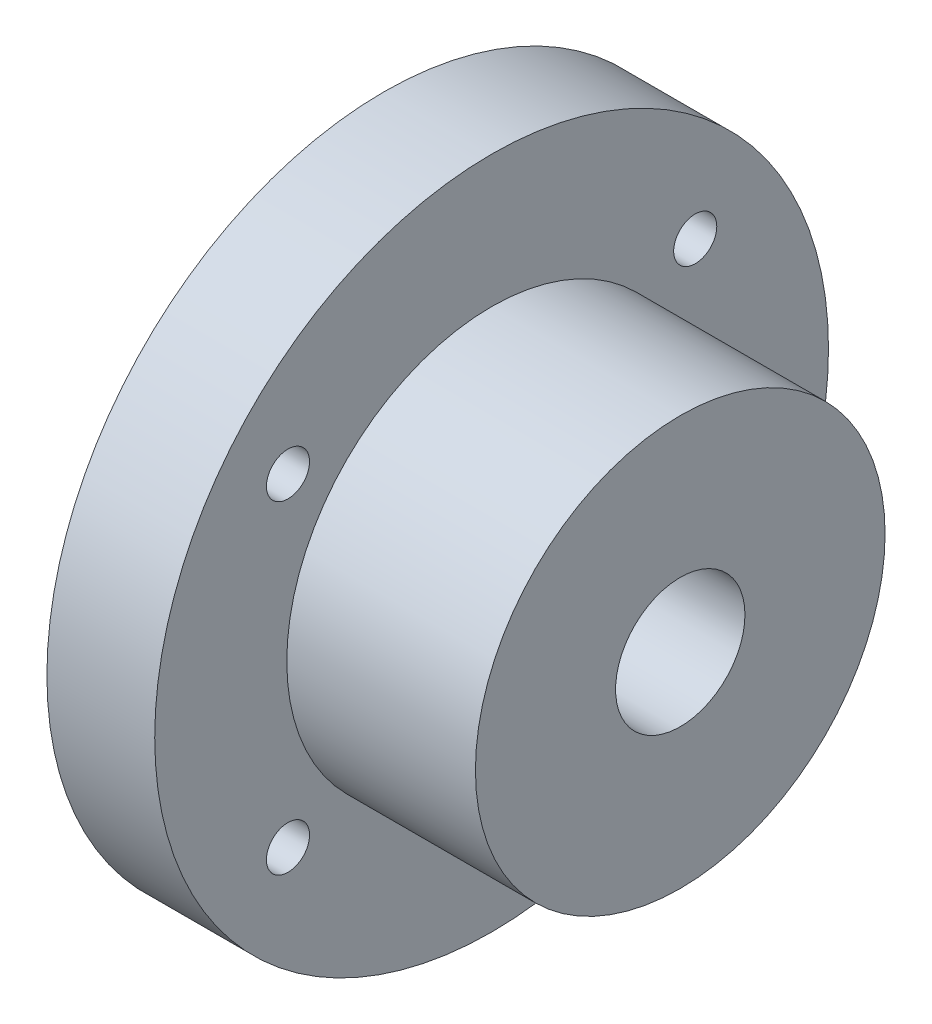
ISO-10303-21;
HEADER;
FILE_DESCRIPTION(('STEP AP214'),'2;1');
FILE_NAME('part.step','',(''),(''),'','','');
FILE_SCHEMA(('AUTOMOTIVE_DESIGN { 1 0 10303 214 1 1 1 1 }'));
ENDSEC;
DATA;
#1=APPLICATION_CONTEXT('core data for automotive mechanical design processes');
#2=APPLICATION_PROTOCOL_DEFINITION('international standard','automotive_design',2000,#1);
#3=PRODUCT_CONTEXT('',#1,'mechanical');
#4=PRODUCT('Part','Part','',(#3));
#5=PRODUCT_RELATED_PRODUCT_CATEGORY('part','',(#4));
#6=PRODUCT_DEFINITION_FORMATION('','',#4);
#7=PRODUCT_DEFINITION_CONTEXT('part definition',#1,'design');
#8=PRODUCT_DEFINITION('design','',#6,#7);
#9=PRODUCT_DEFINITION_SHAPE('','',#8);
#10=(LENGTH_UNIT() NAMED_UNIT(*) SI_UNIT(.MILLI.,.METRE.));
#11=(NAMED_UNIT(*) PLANE_ANGLE_UNIT() SI_UNIT($,.RADIAN.));
#12=(NAMED_UNIT(*) SI_UNIT($,.STERADIAN.) SOLID_ANGLE_UNIT());
#13=UNCERTAINTY_MEASURE_WITH_UNIT(LENGTH_MEASURE(1.E-05),#10,'distance_accuracy_value','');
#14=(GEOMETRIC_REPRESENTATION_CONTEXT(3) GLOBAL_UNCERTAINTY_ASSIGNED_CONTEXT((#13)) GLOBAL_UNIT_ASSIGNED_CONTEXT((#10,
#11,#12)) REPRESENTATION_CONTEXT('',''));
#15=CARTESIAN_POINT('',(0.,0.,0.));
#16=DIRECTION('',(0.,0.,1.));
#17=DIRECTION('',(1.,0.,0.));
#18=AXIS2_PLACEMENT_3D('',#15,#16,#17);
#19=CARTESIAN_POINT('',(20.,0.,0.));
#20=DIRECTION('',(1.,0.,0.));
#21=DIRECTION('',(0.,0.,-1.));
#22=AXIS2_PLACEMENT_3D('',#19,#20,#21);
#23=PLANE('',#22);
#24=CARTESIAN_POINT('',(20.,0.,0.));
#25=DIRECTION('',(1.,0.,0.));
#26=DIRECTION('',(0.,0.,-1.));
#27=AXIS2_PLACEMENT_3D('',#24,#25,#26);
#28=CIRCLE('',#27,38.);
#29=CARTESIAN_POINT('',(20.,0.,-38.));
#30=VERTEX_POINT('',#29);
#31=EDGE_CURVE('E76',#30,#30,#28,.T.);
#32=ORIENTED_EDGE('',*,*,#31,.F.);
#33=EDGE_LOOP('',(#32));
#34=FACE_BOUND('',#33,.T.);
#35=CARTESIAN_POINT('',(20.,-30.,-37.775));
#36=DIRECTION('',(1.,0.,0.));
#37=DIRECTION('',(0.,0.,-1.));
#38=AXIS2_PLACEMENT_3D('',#35,#36,#37);
#39=CIRCLE('',#38,4.);
#40=CARTESIAN_POINT('',(20.,-30.,-41.775));
#41=VERTEX_POINT('',#40);
#42=EDGE_CURVE('E61',#41,#41,#39,.T.);
#43=ORIENTED_EDGE('',*,*,#42,.F.);
#44=EDGE_LOOP('',(#43));
#45=FACE_BOUND('',#44,.T.);
#46=CARTESIAN_POINT('',(20.,30.,37.775));
#47=DIRECTION('',(1.,0.,0.));
#48=DIRECTION('',(0.,0.,-1.));
#49=AXIS2_PLACEMENT_3D('',#46,#47,#48);
#50=CIRCLE('',#49,4.);
#51=CARTESIAN_POINT('',(20.,30.,33.775));
#52=VERTEX_POINT('',#51);
#53=EDGE_CURVE('E50',#52,#52,#50,.T.);
#54=ORIENTED_EDGE('',*,*,#53,.F.);
#55=EDGE_LOOP('',(#54));
#56=FACE_BOUND('',#55,.T.);
#57=CARTESIAN_POINT('',(20.,0.,0.));
#58=DIRECTION('',(1.,0.,0.));
#59=DIRECTION('',(0.,0.,-1.));
#60=AXIS2_PLACEMENT_3D('',#57,#58,#59);
#61=CIRCLE('',#60,62.5);
#62=CARTESIAN_POINT('',(20.,0.,-62.5));
#63=VERTEX_POINT('',#62);
#64=EDGE_CURVE('E10',#63,#63,#61,.T.);
#65=ORIENTED_EDGE('',*,*,#64,.T.);
#66=EDGE_LOOP('',(#65));
#67=FACE_BOUND('',#66,.T.);
#68=CARTESIAN_POINT('',(20.,30.,-37.775));
#69=DIRECTION('',(1.,0.,0.));
#70=DIRECTION('',(0.,0.,-1.));
#71=AXIS2_PLACEMENT_3D('',#68,#69,#70);
#72=CIRCLE('',#71,4.);
#73=CARTESIAN_POINT('',(20.,30.,-41.775));
#74=VERTEX_POINT('',#73);
#75=EDGE_CURVE('E55',#74,#74,#72,.T.);
#76=ORIENTED_EDGE('',*,*,#75,.F.);
#77=EDGE_LOOP('',(#76));
#78=FACE_BOUND('',#77,.T.);
#79=CARTESIAN_POINT('',(20.,-30.,37.775));
#80=DIRECTION('',(1.,0.,0.));
#81=DIRECTION('',(0.,0.,-1.));
#82=AXIS2_PLACEMENT_3D('',#79,#80,#81);
#83=CIRCLE('',#82,4.);
#84=CARTESIAN_POINT('',(20.,-30.,33.775));
#85=VERTEX_POINT('',#84);
#86=EDGE_CURVE('E67',#85,#85,#83,.T.);
#87=ORIENTED_EDGE('',*,*,#86,.F.);
#88=EDGE_LOOP('',(#87));
#89=FACE_BOUND('',#88,.T.);
#90=ADVANCED_FACE('F39',(#34,#45,#56,#67,#78,#89),#23,.T.);
#91=CARTESIAN_POINT('',(0.,0.,0.));
#92=DIRECTION('',(1.,0.,0.));
#93=DIRECTION('',(0.,0.,-1.));
#94=AXIS2_PLACEMENT_3D('',#91,#92,#93);
#95=PLANE('',#94);
#96=CARTESIAN_POINT('',(0.,0.,0.));
#97=DIRECTION('',(1.,0.,0.));
#98=DIRECTION('',(0.,0.,-1.));
#99=AXIS2_PLACEMENT_3D('',#96,#97,#98);
#100=CIRCLE('',#99,62.5);
#101=CARTESIAN_POINT('',(0.,0.,-62.5));
#102=VERTEX_POINT('',#101);
#103=EDGE_CURVE('E43',#102,#102,#100,.T.);
#104=ORIENTED_EDGE('',*,*,#103,.F.);
#105=EDGE_LOOP('',(#104));
#106=FACE_BOUND('',#105,.T.);
#107=CARTESIAN_POINT('',(0.,30.,37.775));
#108=DIRECTION('',(1.,0.,0.));
#109=DIRECTION('',(0.,0.,-1.));
#110=AXIS2_PLACEMENT_3D('',#107,#108,#109);
#111=CIRCLE('',#110,4.);
#112=CARTESIAN_POINT('',(0.,30.,33.775));
#113=VERTEX_POINT('',#112);
#114=EDGE_CURVE('E52',#113,#113,#111,.T.);
#115=ORIENTED_EDGE('',*,*,#114,.T.);
#116=EDGE_LOOP('',(#115));
#117=FACE_BOUND('',#116,.T.);
#118=CARTESIAN_POINT('',(0.,30.,-37.775));
#119=DIRECTION('',(1.,0.,0.));
#120=DIRECTION('',(0.,0.,-1.));
#121=AXIS2_PLACEMENT_3D('',#118,#119,#120);
#122=CIRCLE('',#121,4.);
#123=CARTESIAN_POINT('',(0.,30.,-41.775));
#124=VERTEX_POINT('',#123);
#125=EDGE_CURVE('E58',#124,#124,#122,.T.);
#126=ORIENTED_EDGE('',*,*,#125,.T.);
#127=EDGE_LOOP('',(#126));
#128=FACE_BOUND('',#127,.T.);
#129=CARTESIAN_POINT('',(0.,-30.,-37.775));
#130=DIRECTION('',(1.,0.,0.));
#131=DIRECTION('',(0.,0.,-1.));
#132=AXIS2_PLACEMENT_3D('',#129,#130,#131);
#133=CIRCLE('',#132,4.);
#134=CARTESIAN_POINT('',(0.,-30.,-41.775));
#135=VERTEX_POINT('',#134);
#136=EDGE_CURVE('E64',#135,#135,#133,.T.);
#137=ORIENTED_EDGE('',*,*,#136,.T.);
#138=EDGE_LOOP('',(#137));
#139=FACE_BOUND('',#138,.T.);
#140=CARTESIAN_POINT('',(0.,-30.,37.775));
#141=DIRECTION('',(1.,0.,0.));
#142=DIRECTION('',(0.,0.,-1.));
#143=AXIS2_PLACEMENT_3D('',#140,#141,#142);
#144=CIRCLE('',#143,4.);
#145=CARTESIAN_POINT('',(0.,-30.,33.775));
#146=VERTEX_POINT('',#145);
#147=EDGE_CURVE('E70',#146,#146,#144,.T.);
#148=ORIENTED_EDGE('',*,*,#147,.T.);
#149=EDGE_LOOP('',(#148));
#150=FACE_BOUND('',#149,.T.);
#151=ADVANCED_FACE('F111',(#106,#117,#128,#139,#150),#95,.F.);
#152=CARTESIAN_POINT('',(20.,0.,0.));
#153=DIRECTION('',(-1.,0.,0.));
#154=DIRECTION('',(0.,0.,1.));
#155=AXIS2_PLACEMENT_3D('',#152,#153,#154);
#156=CYLINDRICAL_SURFACE('',#155,62.5);
#157=ORIENTED_EDGE('',*,*,#64,.F.);
#158=EDGE_LOOP('',(#157));
#159=FACE_BOUND('',#158,.T.);
#160=ORIENTED_EDGE('',*,*,#103,.T.);
#161=EDGE_LOOP('',(#160));
#162=FACE_BOUND('',#161,.T.);
#163=ADVANCED_FACE('F41',(#159,#162),#156,.T.);
#164=CARTESIAN_POINT('',(20.,30.,37.775));
#165=DIRECTION('',(-1.,0.,0.));
#166=DIRECTION('',(0.,0.,1.));
#167=AXIS2_PLACEMENT_3D('',#164,#165,#166);
#168=CYLINDRICAL_SURFACE('',#167,4.);
#169=ORIENTED_EDGE('',*,*,#53,.T.);
#170=EDGE_LOOP('',(#169));
#171=FACE_BOUND('',#170,.T.);
#172=ORIENTED_EDGE('',*,*,#114,.F.);
#173=EDGE_LOOP('',(#172));
#174=FACE_BOUND('',#173,.T.);
#175=ADVANCED_FACE('F132',(#171,#174),#168,.F.);
#176=CARTESIAN_POINT('',(20.,30.,-37.775));
#177=DIRECTION('',(-1.,0.,0.));
#178=DIRECTION('',(0.,0.,1.));
#179=AXIS2_PLACEMENT_3D('',#176,#177,#178);
#180=CYLINDRICAL_SURFACE('',#179,4.);
#181=ORIENTED_EDGE('',*,*,#75,.T.);
#182=EDGE_LOOP('',(#181));
#183=FACE_BOUND('',#182,.T.);
#184=ORIENTED_EDGE('',*,*,#125,.F.);
#185=EDGE_LOOP('',(#184));
#186=FACE_BOUND('',#185,.T.);
#187=ADVANCED_FACE('F139',(#183,#186),#180,.F.);
#188=CARTESIAN_POINT('',(20.,-30.,-37.775));
#189=DIRECTION('',(-1.,0.,0.));
#190=DIRECTION('',(0.,0.,1.));
#191=AXIS2_PLACEMENT_3D('',#188,#189,#190);
#192=CYLINDRICAL_SURFACE('',#191,4.);
#193=ORIENTED_EDGE('',*,*,#42,.T.);
#194=EDGE_LOOP('',(#193));
#195=FACE_BOUND('',#194,.T.);
#196=ORIENTED_EDGE('',*,*,#136,.F.);
#197=EDGE_LOOP('',(#196));
#198=FACE_BOUND('',#197,.T.);
#199=ADVANCED_FACE('F123',(#195,#198),#192,.F.);
#200=CARTESIAN_POINT('',(20.,-30.,37.775));
#201=DIRECTION('',(-1.,0.,0.));
#202=DIRECTION('',(0.,0.,1.));
#203=AXIS2_PLACEMENT_3D('',#200,#201,#202);
#204=CYLINDRICAL_SURFACE('',#203,4.);
#205=ORIENTED_EDGE('',*,*,#86,.T.);
#206=EDGE_LOOP('',(#205));
#207=FACE_BOUND('',#206,.T.);
#208=ORIENTED_EDGE('',*,*,#147,.F.);
#209=EDGE_LOOP('',(#208));
#210=FACE_BOUND('',#209,.T.);
#211=ADVANCED_FACE('F105',(#207,#210),#204,.F.);
#212=CARTESIAN_POINT('',(55.,0.,0.));
#213=DIRECTION('',(-1.,0.,0.));
#214=DIRECTION('',(0.,0.,1.));
#215=AXIS2_PLACEMENT_3D('',#212,#213,#214);
#216=CYLINDRICAL_SURFACE('',#215,38.);
#217=CARTESIAN_POINT('',(55.,0.,0.));
#218=DIRECTION('',(1.,0.,0.));
#219=DIRECTION('',(0.,0.,-1.));
#220=AXIS2_PLACEMENT_3D('',#217,#218,#219);
#221=CIRCLE('',#220,38.);
#222=CARTESIAN_POINT('',(55.,0.,-38.));
#223=VERTEX_POINT('',#222);
#224=EDGE_CURVE('E73',#223,#223,#221,.T.);
#225=ORIENTED_EDGE('',*,*,#224,.F.);
#226=EDGE_LOOP('',(#225));
#227=FACE_BOUND('',#226,.T.);
#228=ORIENTED_EDGE('',*,*,#31,.T.);
#229=EDGE_LOOP('',(#228));
#230=FACE_BOUND('',#229,.T.);
#231=ADVANCED_FACE('F99',(#227,#230),#216,.T.);
#232=CARTESIAN_POINT('',(55.,0.,0.));
#233=DIRECTION('',(1.,0.,0.));
#234=DIRECTION('',(0.,0.,-1.));
#235=AXIS2_PLACEMENT_3D('',#232,#233,#234);
#236=PLANE('',#235);
#237=CARTESIAN_POINT('',(55.,0.,0.));
#238=DIRECTION('',(1.,0.,0.));
#239=DIRECTION('',(0.,0.,-1.));
#240=AXIS2_PLACEMENT_3D('',#237,#238,#239);
#241=CIRCLE('',#240,12.);
#242=CARTESIAN_POINT('',(55.,0.,-12.));
#243=VERTEX_POINT('',#242);
#244=EDGE_CURVE('E82',#243,#243,#241,.T.);
#245=ORIENTED_EDGE('',*,*,#244,.F.);
#246=EDGE_LOOP('',(#245));
#247=FACE_BOUND('',#246,.T.);
#248=ORIENTED_EDGE('',*,*,#224,.T.);
#249=EDGE_LOOP('',(#248));
#250=FACE_BOUND('',#249,.T.);
#251=ADVANCED_FACE('F93',(#247,#250),#236,.T.);
#252=CARTESIAN_POINT('',(30.,0.,0.));
#253=DIRECTION('',(1.,0.,0.));
#254=DIRECTION('',(0.,0.,-1.));
#255=AXIS2_PLACEMENT_3D('',#252,#253,#254);
#256=CYLINDRICAL_SURFACE('',#255,12.);
#257=CARTESIAN_POINT('',(30.,0.,0.));
#258=DIRECTION('',(1.,0.,0.));
#259=DIRECTION('',(0.,0.,-1.));
#260=AXIS2_PLACEMENT_3D('',#257,#258,#259);
#261=CIRCLE('',#260,12.);
#262=CARTESIAN_POINT('',(30.,0.,-12.));
#263=VERTEX_POINT('',#262);
#264=EDGE_CURVE('E79',#263,#263,#261,.T.);
#265=ORIENTED_EDGE('',*,*,#264,.F.);
#266=EDGE_LOOP('',(#265));
#267=FACE_BOUND('',#266,.T.);
#268=ORIENTED_EDGE('',*,*,#244,.T.);
#269=EDGE_LOOP('',(#268));
#270=FACE_BOUND('',#269,.T.);
#271=ADVANCED_FACE('F90',(#267,#270),#256,.F.);
#272=CARTESIAN_POINT('',(30.,0.,0.));
#273=DIRECTION('',(1.,0.,0.));
#274=DIRECTION('',(0.,0.,-1.));
#275=AXIS2_PLACEMENT_3D('',#272,#273,#274);
#276=PLANE('',#275);
#277=ORIENTED_EDGE('',*,*,#264,.T.);
#278=EDGE_LOOP('',(#277));
#279=FACE_BOUND('',#278,.T.);
#280=ADVANCED_FACE('F88',(#279),#276,.T.);
#281=CLOSED_SHELL('',(#90,#151,#163,#175,#187,#199,#211,#231,#251,#271,#280));
#282=MANIFOLD_SOLID_BREP('B2',#281);
#283=ADVANCED_BREP_SHAPE_REPRESENTATION('',(#18,#282),#14);
#284=SHAPE_DEFINITION_REPRESENTATION(#9,#283);
ENDSEC;
END-ISO-10303-21;
